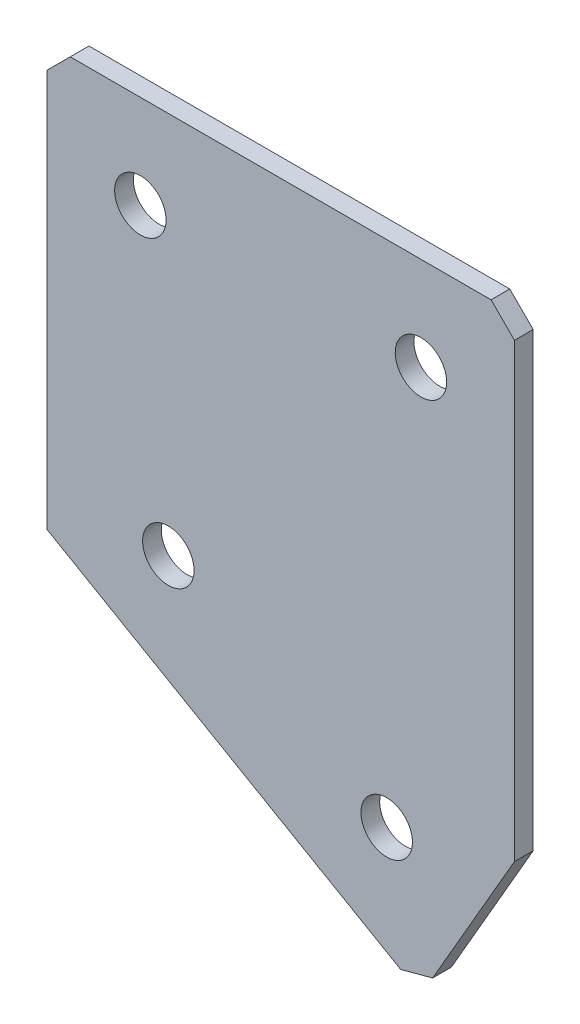
ISO-10303-21;
HEADER;
FILE_DESCRIPTION(('STEP AP214'),'2;1');
FILE_NAME('part.step','',(''),(''),'','','');
FILE_SCHEMA(('AUTOMOTIVE_DESIGN { 1 0 10303 214 1 1 1 1 }'));
ENDSEC;
DATA;
#1=APPLICATION_CONTEXT('core data for automotive mechanical design processes');
#2=APPLICATION_PROTOCOL_DEFINITION('international standard','automotive_design',2000,#1);
#3=PRODUCT_CONTEXT('',#1,'mechanical');
#4=PRODUCT('Part','Part','',(#3));
#5=PRODUCT_RELATED_PRODUCT_CATEGORY('part','',(#4));
#6=PRODUCT_DEFINITION_FORMATION('','',#4);
#7=PRODUCT_DEFINITION_CONTEXT('part definition',#1,'design');
#8=PRODUCT_DEFINITION('design','',#6,#7);
#9=PRODUCT_DEFINITION_SHAPE('','',#8);
#10=(LENGTH_UNIT() NAMED_UNIT(*) SI_UNIT(.MILLI.,.METRE.));
#11=(NAMED_UNIT(*) PLANE_ANGLE_UNIT() SI_UNIT($,.RADIAN.));
#12=(NAMED_UNIT(*) SI_UNIT($,.STERADIAN.) SOLID_ANGLE_UNIT());
#13=UNCERTAINTY_MEASURE_WITH_UNIT(LENGTH_MEASURE(1.E-05),#10,'distance_accuracy_value','');
#14=(GEOMETRIC_REPRESENTATION_CONTEXT(3) GLOBAL_UNCERTAINTY_ASSIGNED_CONTEXT((#13)) GLOBAL_UNIT_ASSIGNED_CONTEXT((#10,
#11,#12)) REPRESENTATION_CONTEXT('',''));
#15=CARTESIAN_POINT('',(0.,0.,0.));
#16=DIRECTION('',(0.,0.,1.));
#17=DIRECTION('',(1.,0.,0.));
#18=AXIS2_PLACEMENT_3D('',#15,#16,#17);
#19=CARTESIAN_POINT('',(0.,0.,-2.));
#20=DIRECTION('',(1.,0.,0.));
#21=DIRECTION('',(0.,0.,-1.));
#22=AXIS2_PLACEMENT_3D('',#19,#20,#21);
#23=PLANE('',#22);
#24=DIRECTION('',(0.,1.,0.));
#25=VECTOR('',#24,1.);
#26=CARTESIAN_POINT('',(0.,0.,0.));
#27=LINE('',#26,#25);
#28=CARTESIAN_POINT('',(0.,-45.,0.));
#29=VERTEX_POINT('',#28);
#30=CARTESIAN_POINT('',(0.,-2.50000000000002,0.));
#31=VERTEX_POINT('',#30);
#32=EDGE_CURVE('E130',#29,#31,#27,.T.);
#33=ORIENTED_EDGE('',*,*,#32,.T.);
#34=DIRECTION('',(0.,0.,-1.));
#35=VECTOR('',#34,1.);
#36=CARTESIAN_POINT('',(0.,-2.50000000000002,-2.));
#37=LINE('',#36,#35);
#38=CARTESIAN_POINT('',(0.,-2.50000000000002,-2.));
#39=VERTEX_POINT('',#38);
#40=EDGE_CURVE('E11',#31,#39,#37,.T.);
#41=ORIENTED_EDGE('',*,*,#40,.T.);
#42=DIRECTION('',(0.,1.,0.));
#43=VECTOR('',#42,1.);
#44=CARTESIAN_POINT('',(0.,0.,-2.));
#45=LINE('',#44,#43);
#46=CARTESIAN_POINT('',(0.,-45.,-2.));
#47=VERTEX_POINT('',#46);
#48=EDGE_CURVE('E141',#47,#39,#45,.T.);
#49=ORIENTED_EDGE('',*,*,#48,.F.);
#50=DIRECTION('',(0.,0.,1.));
#51=VECTOR('',#50,1.);
#52=CARTESIAN_POINT('',(0.,-45.,-2.));
#53=LINE('',#52,#51);
#54=EDGE_CURVE('E120',#47,#29,#53,.T.);
#55=ORIENTED_EDGE('',*,*,#54,.T.);
#56=EDGE_LOOP('',(#33,#41,#49,#55));
#57=FACE_BOUND('',#56,.T.);
#58=ADVANCED_FACE('F37',(#57),#23,.F.);
#59=CARTESIAN_POINT('',(0.,0.,-2.));
#60=DIRECTION('',(0.,-1.,0.));
#61=DIRECTION('',(0.,0.,-1.));
#62=AXIS2_PLACEMENT_3D('',#59,#60,#61);
#63=PLANE('',#62);
#64=DIRECTION('',(1.,0.,0.));
#65=VECTOR('',#64,1.);
#66=CARTESIAN_POINT('',(0.,0.,0.));
#67=LINE('',#66,#65);
#68=CARTESIAN_POINT('',(2.50000000000002,0.,0.));
#69=VERTEX_POINT('',#68);
#70=CARTESIAN_POINT('',(47.5,0.,0.));
#71=VERTEX_POINT('',#70);
#72=EDGE_CURVE('E133',#69,#71,#67,.T.);
#73=ORIENTED_EDGE('',*,*,#72,.T.);
#74=DIRECTION('',(0.,0.,-1.));
#75=VECTOR('',#74,1.);
#76=CARTESIAN_POINT('',(47.5,0.,-2.));
#77=LINE('',#76,#75);
#78=CARTESIAN_POINT('',(47.5,0.,-2.));
#79=VERTEX_POINT('',#78);
#80=EDGE_CURVE('E45',#71,#79,#77,.T.);
#81=ORIENTED_EDGE('',*,*,#80,.T.);
#82=DIRECTION('',(1.,0.,0.));
#83=VECTOR('',#82,1.);
#84=CARTESIAN_POINT('',(0.,0.,-2.));
#85=LINE('',#84,#83);
#86=CARTESIAN_POINT('',(2.50000000000002,0.,-2.));
#87=VERTEX_POINT('',#86);
#88=EDGE_CURVE('E109',#87,#79,#85,.T.);
#89=ORIENTED_EDGE('',*,*,#88,.F.);
#90=DIRECTION('',(0.,0.,1.));
#91=VECTOR('',#90,1.);
#92=CARTESIAN_POINT('',(2.50000000000002,0.,-2.));
#93=LINE('',#92,#91);
#94=EDGE_CURVE('E160',#87,#69,#93,.T.);
#95=ORIENTED_EDGE('',*,*,#94,.T.);
#96=EDGE_LOOP('',(#73,#81,#89,#95));
#97=FACE_BOUND('',#96,.T.);
#98=ADVANCED_FACE('F164',(#97),#63,.F.);
#99=CARTESIAN_POINT('',(50.,0.,-2.));
#100=DIRECTION('',(-1.,0.,0.));
#101=DIRECTION('',(0.,-1.,0.));
#102=AXIS2_PLACEMENT_3D('',#99,#100,#101);
#103=PLANE('',#102);
#104=DIRECTION('',(0.,-1.,0.));
#105=VECTOR('',#104,1.);
#106=CARTESIAN_POINT('',(50.,0.,-2.));
#107=LINE('',#106,#105);
#108=CARTESIAN_POINT('',(50.,-2.5,-2.));
#109=VERTEX_POINT('',#108);
#110=CARTESIAN_POINT('',(50.,-50.7735026918963,-2.));
#111=VERTEX_POINT('',#110);
#112=EDGE_CURVE('E100',#109,#111,#107,.T.);
#113=ORIENTED_EDGE('',*,*,#112,.F.);
#114=DIRECTION('',(0.,0.,1.));
#115=VECTOR('',#114,1.);
#116=CARTESIAN_POINT('',(50.,-2.5,-2.));
#117=LINE('',#116,#115);
#118=CARTESIAN_POINT('',(50.,-2.5,0.));
#119=VERTEX_POINT('',#118);
#120=EDGE_CURVE('E158',#109,#119,#117,.T.);
#121=ORIENTED_EDGE('',*,*,#120,.T.);
#122=DIRECTION('',(0.,-1.,0.));
#123=VECTOR('',#122,1.);
#124=CARTESIAN_POINT('',(50.,0.,0.));
#125=LINE('',#124,#123);
#126=CARTESIAN_POINT('',(50.,-50.7735026918963,0.));
#127=VERTEX_POINT('',#126);
#128=EDGE_CURVE('E115',#119,#127,#125,.T.);
#129=ORIENTED_EDGE('',*,*,#128,.T.);
#130=DIRECTION('',(0.,0.,1.));
#131=VECTOR('',#130,1.);
#132=CARTESIAN_POINT('',(50.,-50.7735026918963,-2.));
#133=LINE('',#132,#131);
#134=EDGE_CURVE('E112',#111,#127,#133,.T.);
#135=ORIENTED_EDGE('',*,*,#134,.F.);
#136=EDGE_LOOP('',(#113,#121,#129,#135));
#137=FACE_BOUND('',#136,.T.);
#138=ADVANCED_FACE('F113',(#137),#103,.F.);
#139=CARTESIAN_POINT('',(40.,-68.0940107675851,-2.));
#140=DIRECTION('',(-0.866025403784438,0.500000000000001,0.));
#141=DIRECTION('',(-0.500000000000001,-0.866025403784438,0.));
#142=AXIS2_PLACEMENT_3D('',#139,#140,#141);
#143=PLANE('',#142);
#144=DIRECTION('',(-0.500000000000001,-0.866025403784438,0.));
#145=VECTOR('',#144,1.);
#146=CARTESIAN_POINT('',(40.,-68.0940107675851,0.));
#147=LINE('',#146,#145);
#148=CARTESIAN_POINT('',(41.25,-65.928947258124,0.));
#149=VERTEX_POINT('',#148);
#150=EDGE_CURVE('E137',#127,#149,#147,.T.);
#151=ORIENTED_EDGE('',*,*,#150,.T.);
#152=DIRECTION('',(0.,0.,-1.));
#153=VECTOR('',#152,1.);
#154=CARTESIAN_POINT('',(41.25,-65.928947258124,-2.));
#155=LINE('',#154,#153);
#156=CARTESIAN_POINT('',(41.25,-65.928947258124,-2.));
#157=VERTEX_POINT('',#156);
#158=EDGE_CURVE('E124',#149,#157,#155,.T.);
#159=ORIENTED_EDGE('',*,*,#158,.T.);
#160=DIRECTION('',(-0.500000000000001,-0.866025403784438,0.));
#161=VECTOR('',#160,1.);
#162=CARTESIAN_POINT('',(40.,-68.0940107675851,-2.));
#163=LINE('',#162,#161);
#164=EDGE_CURVE('E104',#111,#157,#163,.T.);
#165=ORIENTED_EDGE('',*,*,#164,.F.);
#166=ORIENTED_EDGE('',*,*,#134,.T.);
#167=EDGE_LOOP('',(#151,#159,#165,#166));
#168=FACE_BOUND('',#167,.T.);
#169=ADVANCED_FACE('F122',(#168),#143,.F.);
#170=CARTESIAN_POINT('',(0.,-45.,-2.));
#171=DIRECTION('',(0.500000000000001,0.866025403784438,0.));
#172=DIRECTION('',(-0.866025403784438,0.500000000000001,0.));
#173=AXIS2_PLACEMENT_3D('',#170,#171,#172);
#174=PLANE('',#173);
#175=DIRECTION('',(-0.866025403784438,0.500000000000001,0.));
#176=VECTOR('',#175,1.);
#177=CARTESIAN_POINT('',(0.,-45.,-2.));
#178=LINE('',#177,#176);
#179=CARTESIAN_POINT('',(37.8349364905389,-66.8440107675851,-2.));
#180=VERTEX_POINT('',#179);
#181=EDGE_CURVE('E125',#180,#47,#178,.T.);
#182=ORIENTED_EDGE('',*,*,#181,.F.);
#183=DIRECTION('',(0.,0.,1.));
#184=VECTOR('',#183,1.);
#185=CARTESIAN_POINT('',(37.8349364905389,-66.8440107675851,-2.));
#186=LINE('',#185,#184);
#187=CARTESIAN_POINT('',(37.8349364905389,-66.8440107675851,0.));
#188=VERTEX_POINT('',#187);
#189=EDGE_CURVE('E119',#180,#188,#186,.T.);
#190=ORIENTED_EDGE('',*,*,#189,.T.);
#191=DIRECTION('',(-0.866025403784438,0.500000000000001,0.));
#192=VECTOR('',#191,1.);
#193=CARTESIAN_POINT('',(0.,-45.,0.));
#194=LINE('',#193,#192);
#195=EDGE_CURVE('E139',#188,#29,#194,.T.);
#196=ORIENTED_EDGE('',*,*,#195,.T.);
#197=ORIENTED_EDGE('',*,*,#54,.F.);
#198=EDGE_LOOP('',(#182,#190,#196,#197));
#199=FACE_BOUND('',#198,.T.);
#200=ADVANCED_FACE('F194',(#199),#174,.F.);
#201=CARTESIAN_POINT('',(0.,0.,-2.));
#202=DIRECTION('',(0.,0.,1.));
#203=DIRECTION('',(1.,0.,0.));
#204=AXIS2_PLACEMENT_3D('',#201,#202,#203);
#205=PLANE('',#204);
#206=CARTESIAN_POINT('',(10.,-10.,-2.));
#207=DIRECTION('',(0.,0.,-1.));
#208=DIRECTION('',(0.,1.,0.));
#209=AXIS2_PLACEMENT_3D('',#206,#207,#208);
#210=CIRCLE('',#209,2.75);
#211=CARTESIAN_POINT('',(10.,-7.25,-2.));
#212=VERTEX_POINT('',#211);
#213=EDGE_CURVE('E226',#212,#212,#210,.T.);
#214=ORIENTED_EDGE('',*,*,#213,.F.);
#215=EDGE_LOOP('',(#214));
#216=FACE_BOUND('',#215,.T.);
#217=CARTESIAN_POINT('',(40.,-10.,-2.));
#218=DIRECTION('',(0.,0.,-1.));
#219=DIRECTION('',(0.,1.,0.));
#220=AXIS2_PLACEMENT_3D('',#217,#218,#219);
#221=CIRCLE('',#220,2.75);
#222=CARTESIAN_POINT('',(40.,-7.25,-2.));
#223=VERTEX_POINT('',#222);
#224=EDGE_CURVE('E228',#223,#223,#221,.T.);
#225=ORIENTED_EDGE('',*,*,#224,.F.);
#226=EDGE_LOOP('',(#225));
#227=FACE_BOUND('',#226,.T.);
#228=CARTESIAN_POINT('',(12.9903810567666,-40.9529946162076,-2.));
#229=DIRECTION('',(0.,0.,-1.));
#230=DIRECTION('',(0.,1.,0.));
#231=AXIS2_PLACEMENT_3D('',#228,#229,#230);
#232=CIRCLE('',#231,2.75);
#233=CARTESIAN_POINT('',(12.9903810567666,-38.2029946162076,-2.));
#234=VERTEX_POINT('',#233);
#235=EDGE_CURVE('E236',#234,#234,#232,.T.);
#236=ORIENTED_EDGE('',*,*,#235,.F.);
#237=EDGE_LOOP('',(#236));
#238=FACE_BOUND('',#237,.T.);
#239=CARTESIAN_POINT('',(36.3397459621556,-54.4337567297407,-2.));
#240=DIRECTION('',(0.,0.,-1.));
#241=DIRECTION('',(0.,1.,0.));
#242=AXIS2_PLACEMENT_3D('',#239,#240,#241);
#243=CIRCLE('',#242,2.75);
#244=CARTESIAN_POINT('',(36.3397459621556,-51.6837567297407,-2.));
#245=VERTEX_POINT('',#244);
#246=EDGE_CURVE('E242',#245,#245,#243,.T.);
#247=ORIENTED_EDGE('',*,*,#246,.F.);
#248=EDGE_LOOP('',(#247));
#249=FACE_BOUND('',#248,.T.);
#250=ORIENTED_EDGE('',*,*,#164,.T.);
#251=DIRECTION('',(0.965925826289068,0.258819045102523,0.));
#252=VECTOR('',#251,1.);
#253=CARTESIAN_POINT('',(37.8349364905389,-66.8440107675851,-2.));
#254=LINE('',#253,#252);
#255=EDGE_CURVE('E156',#157,#180,#254,.F.);
#256=ORIENTED_EDGE('',*,*,#255,.T.);
#257=ORIENTED_EDGE('',*,*,#181,.T.);
#258=ORIENTED_EDGE('',*,*,#48,.T.);
#259=DIRECTION('',(-0.707106781186548,-0.707106781186548,0.));
#260=VECTOR('',#259,1.);
#261=CARTESIAN_POINT('',(2.50000000000002,0.,-2.));
#262=LINE('',#261,#260);
#263=EDGE_CURVE('E153',#39,#87,#262,.F.);
#264=ORIENTED_EDGE('',*,*,#263,.T.);
#265=ORIENTED_EDGE('',*,*,#88,.T.);
#266=DIRECTION('',(-0.707106781186549,0.707106781186547,0.));
#267=VECTOR('',#266,1.);
#268=CARTESIAN_POINT('',(50.,-2.5,-2.));
#269=LINE('',#268,#267);
#270=EDGE_CURVE('E52',#79,#109,#269,.F.);
#271=ORIENTED_EDGE('',*,*,#270,.T.);
#272=ORIENTED_EDGE('',*,*,#112,.T.);
#273=EDGE_LOOP('',(#250,#256,#257,#258,#264,#265,#271,#272));
#274=FACE_BOUND('',#273,.T.);
#275=ADVANCED_FACE('F102',(#216,#227,#238,#249,#274),#205,.F.);
#276=CARTESIAN_POINT('',(0.,0.,0.));
#277=DIRECTION('',(0.,0.,1.));
#278=DIRECTION('',(1.,0.,0.));
#279=AXIS2_PLACEMENT_3D('',#276,#277,#278);
#280=PLANE('',#279);
#281=CARTESIAN_POINT('',(10.,-10.,0.));
#282=DIRECTION('',(0.,0.,-1.));
#283=DIRECTION('',(0.,1.,0.));
#284=AXIS2_PLACEMENT_3D('',#281,#282,#283);
#285=CIRCLE('',#284,2.75);
#286=CARTESIAN_POINT('',(10.,-7.25,0.));
#287=VERTEX_POINT('',#286);
#288=EDGE_CURVE('E223',#287,#287,#285,.T.);
#289=ORIENTED_EDGE('',*,*,#288,.T.);
#290=EDGE_LOOP('',(#289));
#291=FACE_BOUND('',#290,.T.);
#292=CARTESIAN_POINT('',(40.,-10.,0.));
#293=DIRECTION('',(0.,0.,-1.));
#294=DIRECTION('',(0.,1.,0.));
#295=AXIS2_PLACEMENT_3D('',#292,#293,#294);
#296=CIRCLE('',#295,2.75);
#297=CARTESIAN_POINT('',(40.,-7.25,0.));
#298=VERTEX_POINT('',#297);
#299=EDGE_CURVE('E233',#298,#298,#296,.T.);
#300=ORIENTED_EDGE('',*,*,#299,.T.);
#301=EDGE_LOOP('',(#300));
#302=FACE_BOUND('',#301,.T.);
#303=CARTESIAN_POINT('',(12.9903810567666,-40.9529946162076,0.));
#304=DIRECTION('',(0.,0.,-1.));
#305=DIRECTION('',(0.,1.,0.));
#306=AXIS2_PLACEMENT_3D('',#303,#304,#305);
#307=CIRCLE('',#306,2.75);
#308=CARTESIAN_POINT('',(12.9903810567666,-38.2029946162076,0.));
#309=VERTEX_POINT('',#308);
#310=EDGE_CURVE('E239',#309,#309,#307,.T.);
#311=ORIENTED_EDGE('',*,*,#310,.T.);
#312=EDGE_LOOP('',(#311));
#313=FACE_BOUND('',#312,.T.);
#314=CARTESIAN_POINT('',(36.3397459621556,-54.4337567297407,0.));
#315=DIRECTION('',(0.,0.,-1.));
#316=DIRECTION('',(0.,1.,0.));
#317=AXIS2_PLACEMENT_3D('',#314,#315,#316);
#318=CIRCLE('',#317,2.75);
#319=CARTESIAN_POINT('',(36.3397459621556,-51.6837567297407,0.));
#320=VERTEX_POINT('',#319);
#321=EDGE_CURVE('E134',#320,#320,#318,.T.);
#322=ORIENTED_EDGE('',*,*,#321,.T.);
#323=EDGE_LOOP('',(#322));
#324=FACE_BOUND('',#323,.T.);
#325=ORIENTED_EDGE('',*,*,#195,.F.);
#326=DIRECTION('',(-0.965925826289068,-0.258819045102523,0.));
#327=VECTOR('',#326,1.);
#328=CARTESIAN_POINT('',(19.2454628614771,-71.8250452142119,0.));
#329=LINE('',#328,#327);
#330=EDGE_CURVE('E150',#188,#149,#329,.F.);
#331=ORIENTED_EDGE('',*,*,#330,.T.);
#332=ORIENTED_EDGE('',*,*,#150,.F.);
#333=ORIENTED_EDGE('',*,*,#128,.F.);
#334=DIRECTION('',(0.707106781186549,-0.707106781186547,0.));
#335=VECTOR('',#334,1.);
#336=CARTESIAN_POINT('',(23.7499999999999,23.75,0.));
#337=LINE('',#336,#335);
#338=EDGE_CURVE('E148',#119,#71,#337,.F.);
#339=ORIENTED_EDGE('',*,*,#338,.T.);
#340=ORIENTED_EDGE('',*,*,#72,.F.);
#341=DIRECTION('',(0.707106781186548,0.707106781186548,0.));
#342=VECTOR('',#341,1.);
#343=CARTESIAN_POINT('',(1.25000000000001,-1.25000000000001,0.));
#344=LINE('',#343,#342);
#345=EDGE_CURVE('E146',#69,#31,#344,.F.);
#346=ORIENTED_EDGE('',*,*,#345,.T.);
#347=ORIENTED_EDGE('',*,*,#32,.F.);
#348=EDGE_LOOP('',(#325,#331,#332,#333,#339,#340,#346,#347));
#349=FACE_BOUND('',#348,.T.);
#350=ADVANCED_FACE('F169',(#291,#302,#313,#324,#349),#280,.T.);
#351=CARTESIAN_POINT('',(36.3397459621556,-54.4337567297407,-2.));
#352=DIRECTION('',(0.,0.,-1.));
#353=DIRECTION('',(0.,1.,0.));
#354=AXIS2_PLACEMENT_3D('',#351,#352,#353);
#355=CYLINDRICAL_SURFACE('',#354,2.75);
#356=ORIENTED_EDGE('',*,*,#321,.F.);
#357=EDGE_LOOP('',(#356));
#358=FACE_BOUND('',#357,.T.);
#359=ORIENTED_EDGE('',*,*,#246,.T.);
#360=EDGE_LOOP('',(#359));
#361=FACE_BOUND('',#360,.T.);
#362=ADVANCED_FACE('F200',(#358,#361),#355,.F.);
#363=CARTESIAN_POINT('',(12.9903810567666,-40.9529946162076,-2.));
#364=DIRECTION('',(0.,0.,-1.));
#365=DIRECTION('',(0.,1.,0.));
#366=AXIS2_PLACEMENT_3D('',#363,#364,#365);
#367=CYLINDRICAL_SURFACE('',#366,2.75);
#368=ORIENTED_EDGE('',*,*,#310,.F.);
#369=EDGE_LOOP('',(#368));
#370=FACE_BOUND('',#369,.T.);
#371=ORIENTED_EDGE('',*,*,#235,.T.);
#372=EDGE_LOOP('',(#371));
#373=FACE_BOUND('',#372,.T.);
#374=ADVANCED_FACE('F207',(#370,#373),#367,.F.);
#375=CARTESIAN_POINT('',(40.,-10.,-2.));
#376=DIRECTION('',(0.,0.,-1.));
#377=DIRECTION('',(0.,1.,0.));
#378=AXIS2_PLACEMENT_3D('',#375,#376,#377);
#379=CYLINDRICAL_SURFACE('',#378,2.75);
#380=ORIENTED_EDGE('',*,*,#299,.F.);
#381=EDGE_LOOP('',(#380));
#382=FACE_BOUND('',#381,.T.);
#383=ORIENTED_EDGE('',*,*,#224,.T.);
#384=EDGE_LOOP('',(#383));
#385=FACE_BOUND('',#384,.T.);
#386=ADVANCED_FACE('F211',(#382,#385),#379,.F.);
#387=CARTESIAN_POINT('',(10.,-10.,-2.));
#388=DIRECTION('',(0.,0.,-1.));
#389=DIRECTION('',(0.,1.,0.));
#390=AXIS2_PLACEMENT_3D('',#387,#388,#389);
#391=CYLINDRICAL_SURFACE('',#390,2.75);
#392=ORIENTED_EDGE('',*,*,#288,.F.);
#393=EDGE_LOOP('',(#392));
#394=FACE_BOUND('',#393,.T.);
#395=ORIENTED_EDGE('',*,*,#213,.T.);
#396=EDGE_LOOP('',(#395));
#397=FACE_BOUND('',#396,.T.);
#398=ADVANCED_FACE('F179',(#394,#397),#391,.F.);
#399=CARTESIAN_POINT('',(37.8349364905389,-66.8440107675851,-2.));
#400=DIRECTION('',(-0.258819045102523,0.965925826289068,0.));
#401=DIRECTION('',(0.,0.,1.));
#402=AXIS2_PLACEMENT_3D('',#399,#400,#401);
#403=PLANE('',#402);
#404=ORIENTED_EDGE('',*,*,#255,.F.);
#405=ORIENTED_EDGE('',*,*,#158,.F.);
#406=ORIENTED_EDGE('',*,*,#330,.F.);
#407=ORIENTED_EDGE('',*,*,#189,.F.);
#408=EDGE_LOOP('',(#404,#405,#406,#407));
#409=FACE_BOUND('',#408,.T.);
#410=ADVANCED_FACE('F174',(#409),#403,.F.);
#411=CARTESIAN_POINT('',(50.,-2.5,-2.));
#412=DIRECTION('',(-0.707106781186546,-0.707106781186548,0.));
#413=DIRECTION('',(0.,0.,1.));
#414=AXIS2_PLACEMENT_3D('',#411,#412,#413);
#415=PLANE('',#414);
#416=ORIENTED_EDGE('',*,*,#270,.F.);
#417=ORIENTED_EDGE('',*,*,#80,.F.);
#418=ORIENTED_EDGE('',*,*,#338,.F.);
#419=ORIENTED_EDGE('',*,*,#120,.F.);
#420=EDGE_LOOP('',(#416,#417,#418,#419));
#421=FACE_BOUND('',#420,.T.);
#422=ADVANCED_FACE('F172',(#421),#415,.F.);
#423=CARTESIAN_POINT('',(2.50000000000002,0.,-2.));
#424=DIRECTION('',(0.707106781186547,-0.707106781186547,0.));
#425=DIRECTION('',(0.,0.,1.));
#426=AXIS2_PLACEMENT_3D('',#423,#424,#425);
#427=PLANE('',#426);
#428=ORIENTED_EDGE('',*,*,#263,.F.);
#429=ORIENTED_EDGE('',*,*,#40,.F.);
#430=ORIENTED_EDGE('',*,*,#345,.F.);
#431=ORIENTED_EDGE('',*,*,#94,.F.);
#432=EDGE_LOOP('',(#428,#429,#430,#431));
#433=FACE_BOUND('',#432,.T.);
#434=ADVANCED_FACE('F39',(#433),#427,.F.);
#435=CLOSED_SHELL('',(#58,#98,#138,#169,#200,#275,#350,#362,#374,#386,#398,#410,#422,#434));
#436=MANIFOLD_SOLID_BREP('B2',#435);
#437=ADVANCED_BREP_SHAPE_REPRESENTATION('',(#18,#436),#14);
#438=SHAPE_DEFINITION_REPRESENTATION(#9,#437);
ENDSEC;
END-ISO-10303-21;
